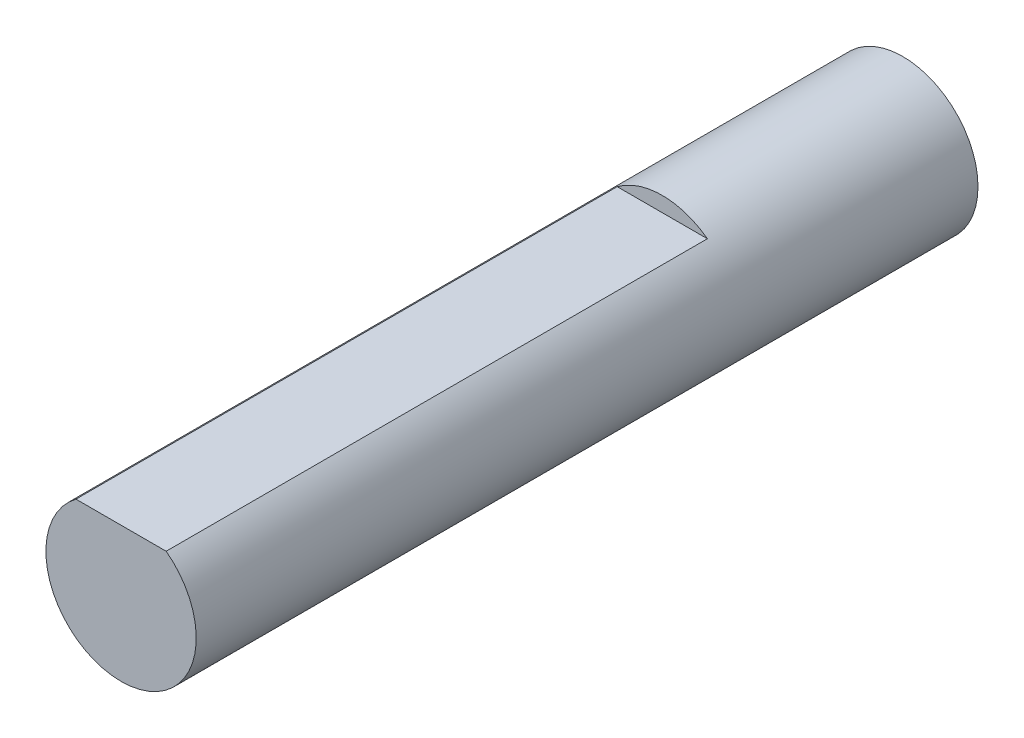
ISO-10303-21;
HEADER;
FILE_DESCRIPTION(('STEP AP214'),'2;1');
FILE_NAME('part.step','',(''),(''),'','','');
FILE_SCHEMA(('AUTOMOTIVE_DESIGN { 1 0 10303 214 1 1 1 1 }'));
ENDSEC;
DATA;
#1=APPLICATION_CONTEXT('core data for automotive mechanical design processes');
#2=APPLICATION_PROTOCOL_DEFINITION('international standard','automotive_design',2000,#1);
#3=PRODUCT_CONTEXT('',#1,'mechanical');
#4=PRODUCT('Part','Part','',(#3));
#5=PRODUCT_RELATED_PRODUCT_CATEGORY('part','',(#4));
#6=PRODUCT_DEFINITION_FORMATION('','',#4);
#7=PRODUCT_DEFINITION_CONTEXT('part definition',#1,'design');
#8=PRODUCT_DEFINITION('design','',#6,#7);
#9=PRODUCT_DEFINITION_SHAPE('','',#8);
#10=(LENGTH_UNIT() NAMED_UNIT(*) SI_UNIT(.MILLI.,.METRE.));
#11=(NAMED_UNIT(*) PLANE_ANGLE_UNIT() SI_UNIT($,.RADIAN.));
#12=(NAMED_UNIT(*) SI_UNIT($,.STERADIAN.) SOLID_ANGLE_UNIT());
#13=UNCERTAINTY_MEASURE_WITH_UNIT(LENGTH_MEASURE(1.E-05),#10,'distance_accuracy_value','');
#14=(GEOMETRIC_REPRESENTATION_CONTEXT(3) GLOBAL_UNCERTAINTY_ASSIGNED_CONTEXT((#13)) GLOBAL_UNIT_ASSIGNED_CONTEXT((#10,
#11,#12)) REPRESENTATION_CONTEXT('',''));
#15=CARTESIAN_POINT('',(0.,0.,0.));
#16=DIRECTION('',(0.,0.,1.));
#17=DIRECTION('',(1.,0.,0.));
#18=AXIS2_PLACEMENT_3D('',#15,#16,#17);
#19=CARTESIAN_POINT('',(-10.7405160119279,9.68564390361357,26.));
#20=DIRECTION('',(0.,0.,-1.));
#21=DIRECTION('',(-1.,0.,0.));
#22=AXIS2_PLACEMENT_3D('',#19,#20,#21);
#23=CYLINDRICAL_SURFACE('',#22,2.5);
#24=CARTESIAN_POINT('',(-10.7405160119279,9.68564390361357,26.));
#25=DIRECTION('',(0.,0.,1.));
#26=DIRECTION('',(1.,0.,0.));
#27=AXIS2_PLACEMENT_3D('',#24,#25,#26);
#28=CIRCLE('',#27,2.5);
#29=CARTESIAN_POINT('',(-12.2405160119279,11.6856439036136,26.));
#30=VERTEX_POINT('',#29);
#31=CARTESIAN_POINT('',(-9.24051601192791,11.6856439036136,26.));
#32=VERTEX_POINT('',#31);
#33=EDGE_CURVE('E76',#30,#32,#28,.T.);
#34=ORIENTED_EDGE('',*,*,#33,.F.);
#35=DIRECTION('',(0.,0.,-1.));
#36=VECTOR('',#35,1.);
#37=CARTESIAN_POINT('',(-12.2405160119279,11.6856439036136,26.));
#38=LINE('',#37,#36);
#39=CARTESIAN_POINT('',(-12.2405160119279,11.6856439036136,8.));
#40=VERTEX_POINT('',#39);
#41=EDGE_CURVE('E60',#30,#40,#38,.T.);
#42=ORIENTED_EDGE('',*,*,#41,.T.);
#43=CARTESIAN_POINT('',(-10.7405160119279,9.68564390361357,8.));
#44=DIRECTION('',(0.,0.,-1.));
#45=DIRECTION('',(-1.,0.,0.));
#46=AXIS2_PLACEMENT_3D('',#43,#44,#45);
#47=CIRCLE('',#46,2.5);
#48=CARTESIAN_POINT('',(-9.24051601192791,11.6856439036136,8.));
#49=VERTEX_POINT('',#48);
#50=EDGE_CURVE('E11',#40,#49,#47,.T.);
#51=ORIENTED_EDGE('',*,*,#50,.T.);
#52=DIRECTION('',(0.,0.,-1.));
#53=VECTOR('',#52,1.);
#54=CARTESIAN_POINT('',(-9.24051601192791,11.6856439036136,26.));
#55=LINE('',#54,#53);
#56=EDGE_CURVE('E65',#49,#32,#55,.F.);
#57=ORIENTED_EDGE('',*,*,#56,.T.);
#58=EDGE_LOOP('',(#34,#42,#51,#57));
#59=FACE_BOUND('',#58,.T.);
#60=CARTESIAN_POINT('',(-10.7405160119279,9.68564390361357,0.));
#61=DIRECTION('',(0.,0.,1.));
#62=DIRECTION('',(1.,0.,0.));
#63=AXIS2_PLACEMENT_3D('',#60,#61,#62);
#64=CIRCLE('',#63,2.5);
#65=CARTESIAN_POINT('',(-8.24051601192791,9.68564390361357,0.));
#66=VERTEX_POINT('',#65);
#67=EDGE_CURVE('E84',#66,#66,#64,.T.);
#68=ORIENTED_EDGE('',*,*,#67,.T.);
#69=EDGE_LOOP('',(#68));
#70=FACE_BOUND('',#69,.T.);
#71=ADVANCED_FACE('F45',(#59,#70),#23,.T.);
#72=CARTESIAN_POINT('',(-10.7405160119279,9.68564390361357,26.));
#73=DIRECTION('',(0.,0.,1.));
#74=DIRECTION('',(1.,0.,0.));
#75=AXIS2_PLACEMENT_3D('',#72,#73,#74);
#76=PLANE('',#75);
#77=DIRECTION('',(1.,0.,0.));
#78=VECTOR('',#77,1.);
#79=CARTESIAN_POINT('',(-10.7405160119279,11.6856439036136,26.));
#80=LINE('',#79,#78);
#81=EDGE_CURVE('E53',#30,#32,#80,.T.);
#82=ORIENTED_EDGE('',*,*,#81,.F.);
#83=ORIENTED_EDGE('',*,*,#33,.T.);
#84=EDGE_LOOP('',(#82,#83));
#85=FACE_BOUND('',#84,.T.);
#86=ADVANCED_FACE('F82',(#85),#76,.T.);
#87=CARTESIAN_POINT('',(-10.7405160119279,9.68564390361357,0.));
#88=DIRECTION('',(0.,0.,1.));
#89=DIRECTION('',(1.,0.,0.));
#90=AXIS2_PLACEMENT_3D('',#87,#88,#89);
#91=PLANE('',#90);
#92=ORIENTED_EDGE('',*,*,#67,.F.);
#93=EDGE_LOOP('',(#92));
#94=FACE_BOUND('',#93,.T.);
#95=ADVANCED_FACE('F96',(#94),#91,.F.);
#96=CARTESIAN_POINT('',(0.,0.,8.));
#97=DIRECTION('',(0.,0.,-1.));
#98=DIRECTION('',(-1.,0.,0.));
#99=AXIS2_PLACEMENT_3D('',#96,#97,#98);
#100=PLANE('',#99);
#101=DIRECTION('',(1.,0.,0.));
#102=VECTOR('',#101,1.);
#103=CARTESIAN_POINT('',(-12.4339052305637,11.6856439036136,8.));
#104=LINE('',#103,#102);
#105=EDGE_CURVE('E80',#40,#49,#104,.T.);
#106=ORIENTED_EDGE('',*,*,#105,.T.);
#107=ORIENTED_EDGE('',*,*,#50,.F.);
#108=EDGE_LOOP('',(#106,#107));
#109=FACE_BOUND('',#108,.T.);
#110=ADVANCED_FACE('F94',(#109),#100,.F.);
#111=CARTESIAN_POINT('',(-12.4339052305637,11.6856439036136,8.));
#112=DIRECTION('',(0.,-1.,0.));
#113=DIRECTION('',(0.,0.,-1.));
#114=AXIS2_PLACEMENT_3D('',#111,#112,#113);
#115=PLANE('',#114);
#116=ORIENTED_EDGE('',*,*,#81,.T.);
#117=ORIENTED_EDGE('',*,*,#56,.F.);
#118=ORIENTED_EDGE('',*,*,#105,.F.);
#119=ORIENTED_EDGE('',*,*,#41,.F.);
#120=EDGE_LOOP('',(#116,#117,#118,#119));
#121=FACE_BOUND('',#120,.T.);
#122=ADVANCED_FACE('F71',(#121),#115,.F.);
#123=CLOSED_SHELL('',(#71,#86,#95,#110,#122));
#124=MANIFOLD_SOLID_BREP('B2',#123);
#125=ADVANCED_BREP_SHAPE_REPRESENTATION('',(#18,#124),#14);
#126=SHAPE_DEFINITION_REPRESENTATION(#9,#125);
ENDSEC;
END-ISO-10303-21;
